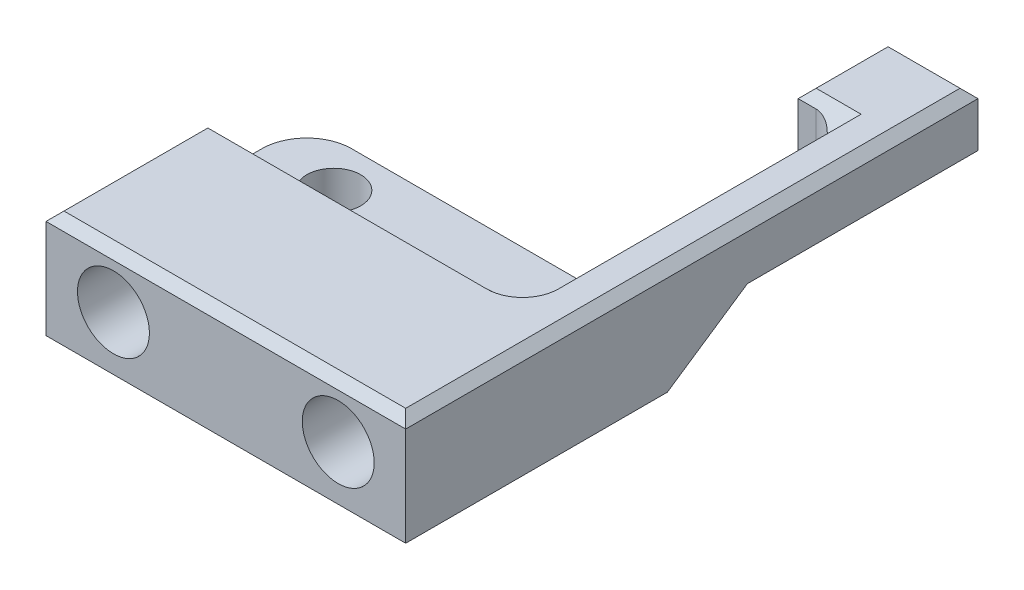
ISO-10303-21;
HEADER;
FILE_DESCRIPTION(('STEP AP214'),'2;1');
FILE_NAME('part.step','',(''),(''),'','','');
FILE_SCHEMA(('AUTOMOTIVE_DESIGN { 1 0 10303 214 1 1 1 1 }'));
ENDSEC;
DATA;
#1=APPLICATION_CONTEXT('core data for automotive mechanical design processes');
#2=APPLICATION_PROTOCOL_DEFINITION('international standard','automotive_design',2000,#1);
#3=PRODUCT_CONTEXT('',#1,'mechanical');
#4=PRODUCT('Part','Part','',(#3));
#5=PRODUCT_RELATED_PRODUCT_CATEGORY('part','',(#4));
#6=PRODUCT_DEFINITION_FORMATION('','',#4);
#7=PRODUCT_DEFINITION_CONTEXT('part definition',#1,'design');
#8=PRODUCT_DEFINITION('design','',#6,#7);
#9=PRODUCT_DEFINITION_SHAPE('','',#8);
#10=(LENGTH_UNIT() NAMED_UNIT(*) SI_UNIT(.MILLI.,.METRE.));
#11=(NAMED_UNIT(*) PLANE_ANGLE_UNIT() SI_UNIT($,.RADIAN.));
#12=(NAMED_UNIT(*) SI_UNIT($,.STERADIAN.) SOLID_ANGLE_UNIT());
#13=UNCERTAINTY_MEASURE_WITH_UNIT(LENGTH_MEASURE(1.E-05),#10,'distance_accuracy_value','');
#14=(GEOMETRIC_REPRESENTATION_CONTEXT(3) GLOBAL_UNCERTAINTY_ASSIGNED_CONTEXT((#13)) GLOBAL_UNIT_ASSIGNED_CONTEXT((#10,
#11,#12)) REPRESENTATION_CONTEXT('',''));
#15=CARTESIAN_POINT('',(0.,0.,0.));
#16=DIRECTION('',(0.,0.,1.));
#17=DIRECTION('',(1.,0.,0.));
#18=AXIS2_PLACEMENT_3D('',#15,#16,#17);
#19=CARTESIAN_POINT('',(-12.5,0.,-3.));
#20=DIRECTION('',(0.,0.,1.));
#21=DIRECTION('',(1.,0.,0.));
#22=AXIS2_PLACEMENT_3D('',#19,#20,#21);
#23=PLANE('',#22);
#24=DIRECTION('',(0.,1.,0.));
#25=VECTOR('',#24,1.);
#26=CARTESIAN_POINT('',(-20.,-88.,-3.));
#27=LINE('',#26,#25);
#28=CARTESIAN_POINT('',(-20.,8.99999999999999,-3.));
#29=VERTEX_POINT('',#28);
#30=CARTESIAN_POINT('',(-20.,11.,-3.));
#31=VERTEX_POINT('',#30);
#32=EDGE_CURVE('E243',#29,#31,#27,.T.);
#33=ORIENTED_EDGE('',*,*,#32,.T.);
#34=DIRECTION('',(1.,0.,0.));
#35=VECTOR('',#34,1.);
#36=CARTESIAN_POINT('',(-12.5,11.,-3.));
#37=LINE('',#36,#35);
#38=CARTESIAN_POINT('',(12.,11.,-3.));
#39=VERTEX_POINT('',#38);
#40=EDGE_CURVE('E440',#31,#39,#37,.T.);
#41=ORIENTED_EDGE('',*,*,#40,.T.);
#42=DIRECTION('',(0.,-1.,0.));
#43=VECTOR('',#42,1.);
#44=CARTESIAN_POINT('',(12.,0.,-3.));
#45=LINE('',#44,#43);
#46=CARTESIAN_POINT('',(12.,9.,-3.));
#47=VERTEX_POINT('',#46);
#48=EDGE_CURVE('E250',#39,#47,#45,.T.);
#49=ORIENTED_EDGE('',*,*,#48,.T.);
#50=DIRECTION('',(1.,0.,0.));
#51=VECTOR('',#50,1.);
#52=CARTESIAN_POINT('',(-20.,9.,-3.));
#53=LINE('',#52,#51);
#54=EDGE_CURVE('E252',#47,#29,#53,.F.);
#55=ORIENTED_EDGE('',*,*,#54,.T.);
#56=EDGE_LOOP('',(#33,#41,#49,#55));
#57=FACE_BOUND('',#56,.T.);
#58=ADVANCED_FACE('F34',(#57),#23,.F.);
#59=CARTESIAN_POINT('',(20.,12.,15.));
#60=DIRECTION('',(-1.,0.,0.));
#61=DIRECTION('',(0.,0.,1.));
#62=AXIS2_PLACEMENT_3D('',#59,#60,#61);
#63=PLANE('',#62);
#64=DIRECTION('',(0.,-1.,0.));
#65=VECTOR('',#64,1.);
#66=CARTESIAN_POINT('',(20.,58.7318147329736,-48.6493429113385));
#67=LINE('',#66,#65);
#68=CARTESIAN_POINT('',(20.,11.,-48.6493429113385));
#69=VERTEX_POINT('',#68);
#70=CARTESIAN_POINT('',(20.,6.,-48.6493429113385));
#71=VERTEX_POINT('',#70);
#72=EDGE_CURVE('E209',#69,#71,#67,.T.);
#73=ORIENTED_EDGE('',*,*,#72,.F.);
#74=DIRECTION('',(0.,0.,1.));
#75=VECTOR('',#74,1.);
#76=CARTESIAN_POINT('',(20.,11.,15.));
#77=LINE('',#76,#75);
#78=CARTESIAN_POINT('',(20.,11.,15.));
#79=VERTEX_POINT('',#78);
#80=EDGE_CURVE('E452',#69,#79,#77,.T.);
#81=ORIENTED_EDGE('',*,*,#80,.T.);
#82=DIRECTION('',(0.,-1.,0.));
#83=VECTOR('',#82,1.);
#84=CARTESIAN_POINT('',(20.,12.,15.));
#85=LINE('',#84,#83);
#86=CARTESIAN_POINT('',(20.,0.,15.));
#87=VERTEX_POINT('',#86);
#88=EDGE_CURVE('E509',#79,#87,#85,.T.);
#89=ORIENTED_EDGE('',*,*,#88,.T.);
#90=DIRECTION('',(0.,0.,-1.));
#91=VECTOR('',#90,1.);
#92=CARTESIAN_POINT('',(20.,0.,15.));
#93=LINE('',#92,#91);
#94=CARTESIAN_POINT('',(20.,0.,-14.1046341889236));
#95=VERTEX_POINT('',#94);
#96=EDGE_CURVE('E566',#87,#95,#93,.T.);
#97=ORIENTED_EDGE('',*,*,#96,.T.);
#98=DIRECTION('',(0.,0.559192903470748,-0.829037572555041));
#99=VECTOR('',#98,1.);
#100=CARTESIAN_POINT('',(20.,6.00000000000001,-23.));
#101=LINE('',#100,#99);
#102=CARTESIAN_POINT('',(20.,6.,-23.));
#103=VERTEX_POINT('',#102);
#104=EDGE_CURVE('E586',#95,#103,#101,.T.);
#105=ORIENTED_EDGE('',*,*,#104,.T.);
#106=DIRECTION('',(0.,0.,-1.));
#107=VECTOR('',#106,1.);
#108=CARTESIAN_POINT('',(20.,6.,0.));
#109=LINE('',#108,#107);
#110=EDGE_CURVE('E207',#103,#71,#109,.T.);
#111=ORIENTED_EDGE('',*,*,#110,.T.);
#112=EDGE_LOOP('',(#73,#81,#89,#97,#105,#111));
#113=FACE_BOUND('',#112,.T.);
#114=ADVANCED_FACE('F325',(#113),#63,.F.);
#115=CARTESIAN_POINT('',(-20.,12.,15.));
#116=DIRECTION('',(1.,0.,0.));
#117=DIRECTION('',(0.,0.,-1.));
#118=AXIS2_PLACEMENT_3D('',#115,#116,#117);
#119=PLANE('',#118);
#120=DIRECTION('',(0.,-1.,0.));
#121=VECTOR('',#120,1.);
#122=CARTESIAN_POINT('',(-20.,12.,15.));
#123=LINE('',#122,#121);
#124=CARTESIAN_POINT('',(-20.,11.,15.));
#125=VERTEX_POINT('',#124);
#126=CARTESIAN_POINT('',(-20.,0.,15.));
#127=VERTEX_POINT('',#126);
#128=EDGE_CURVE('E200',#125,#127,#123,.T.);
#129=ORIENTED_EDGE('',*,*,#128,.F.);
#130=DIRECTION('',(0.,0.,-1.));
#131=VECTOR('',#130,1.);
#132=CARTESIAN_POINT('',(-20.,11.,15.));
#133=LINE('',#132,#131);
#134=EDGE_CURVE('E438',#125,#31,#133,.T.);
#135=ORIENTED_EDGE('',*,*,#134,.T.);
#136=ORIENTED_EDGE('',*,*,#32,.F.);
#137=CARTESIAN_POINT('',(-20.,9.,-5.99999999999999));
#138=DIRECTION('',(1.,0.,0.));
#139=DIRECTION('',(0.,0.,-1.));
#140=AXIS2_PLACEMENT_3D('',#137,#138,#139);
#141=CIRCLE('',#140,3.);
#142=CARTESIAN_POINT('',(-20.,6.,-5.99999999999999));
#143=VERTEX_POINT('',#142);
#144=EDGE_CURVE('E259',#29,#143,#141,.T.);
#145=ORIENTED_EDGE('',*,*,#144,.T.);
#146=DIRECTION('',(0.,0.,1.));
#147=VECTOR('',#146,1.);
#148=CARTESIAN_POINT('',(-20.,6.,-23.));
#149=LINE('',#148,#147);
#150=CARTESIAN_POINT('',(-20.,6.,-9.));
#151=VERTEX_POINT('',#150);
#152=EDGE_CURVE('E208',#151,#143,#149,.T.);
#153=ORIENTED_EDGE('',*,*,#152,.F.);
#154=DIRECTION('',(0.,1.,0.));
#155=VECTOR('',#154,1.);
#156=CARTESIAN_POINT('',(-20.,12.,-9.));
#157=LINE('',#156,#155);
#158=CARTESIAN_POINT('',(-20.,0.,-9.));
#159=VERTEX_POINT('',#158);
#160=EDGE_CURVE('E366',#151,#159,#157,.F.);
#161=ORIENTED_EDGE('',*,*,#160,.T.);
#162=DIRECTION('',(0.,0.,1.));
#163=VECTOR('',#162,1.);
#164=CARTESIAN_POINT('',(-20.,0.,15.));
#165=LINE('',#164,#163);
#166=EDGE_CURVE('E570',#159,#127,#165,.T.);
#167=ORIENTED_EDGE('',*,*,#166,.T.);
#168=EDGE_LOOP('',(#129,#135,#136,#145,#153,#161,#167));
#169=FACE_BOUND('',#168,.T.);
#170=ADVANCED_FACE('F331',(#169),#119,.F.);
#171=CARTESIAN_POINT('',(-20.,12.,15.));
#172=DIRECTION('',(0.,0.,-1.));
#173=DIRECTION('',(-1.,0.,0.));
#174=AXIS2_PLACEMENT_3D('',#171,#172,#173);
#175=PLANE('',#174);
#176=CARTESIAN_POINT('',(12.5,6.,15.));
#177=DIRECTION('',(0.,0.,1.));
#178=DIRECTION('',(1.,0.,0.));
#179=AXIS2_PLACEMENT_3D('',#176,#177,#178);
#180=CIRCLE('',#179,4.);
#181=CARTESIAN_POINT('',(16.5,6.,15.));
#182=VERTEX_POINT('',#181);
#183=EDGE_CURVE('E247',#182,#182,#180,.T.);
#184=ORIENTED_EDGE('',*,*,#183,.F.);
#185=EDGE_LOOP('',(#184));
#186=FACE_BOUND('',#185,.T.);
#187=CARTESIAN_POINT('',(-12.5,6.,15.));
#188=DIRECTION('',(0.,0.,1.));
#189=DIRECTION('',(1.,0.,0.));
#190=AXIS2_PLACEMENT_3D('',#187,#188,#189);
#191=CIRCLE('',#190,4.);
#192=CARTESIAN_POINT('',(-8.5,6.,15.));
#193=VERTEX_POINT('',#192);
#194=EDGE_CURVE('E567',#193,#193,#191,.T.);
#195=ORIENTED_EDGE('',*,*,#194,.F.);
#196=EDGE_LOOP('',(#195));
#197=FACE_BOUND('',#196,.T.);
#198=ORIENTED_EDGE('',*,*,#88,.F.);
#199=DIRECTION('',(-1.,0.,0.));
#200=VECTOR('',#199,1.);
#201=CARTESIAN_POINT('',(-20.,11.,15.));
#202=LINE('',#201,#200);
#203=EDGE_CURVE('E435',#79,#125,#202,.T.);
#204=ORIENTED_EDGE('',*,*,#203,.T.);
#205=ORIENTED_EDGE('',*,*,#128,.T.);
#206=DIRECTION('',(1.,0.,0.));
#207=VECTOR('',#206,1.);
#208=CARTESIAN_POINT('',(-20.,0.,15.));
#209=LINE('',#208,#207);
#210=EDGE_CURVE('E576',#127,#87,#209,.T.);
#211=ORIENTED_EDGE('',*,*,#210,.T.);
#212=EDGE_LOOP('',(#198,#204,#205,#211));
#213=FACE_BOUND('',#212,.T.);
#214=ADVANCED_FACE('F342',(#186,#197,#213),#175,.F.);
#215=CARTESIAN_POINT('',(0.,12.,0.));
#216=DIRECTION('',(0.,-1.,0.));
#217=DIRECTION('',(0.,0.,-1.));
#218=AXIS2_PLACEMENT_3D('',#215,#216,#217);
#219=PLANE('',#218);
#220=DIRECTION('',(0.,0.,1.));
#221=VECTOR('',#220,1.);
#222=CARTESIAN_POINT('',(-19.,12.,0.));
#223=LINE('',#222,#221);
#224=CARTESIAN_POINT('',(-19.,12.,-2.));
#225=VERTEX_POINT('',#224);
#226=CARTESIAN_POINT('',(-19.,12.,14.));
#227=VERTEX_POINT('',#226);
#228=EDGE_CURVE('E430',#225,#227,#223,.T.);
#229=ORIENTED_EDGE('',*,*,#228,.T.);
#230=DIRECTION('',(1.,0.,0.));
#231=VECTOR('',#230,1.);
#232=CARTESIAN_POINT('',(0.,12.,14.));
#233=LINE('',#232,#231);
#234=CARTESIAN_POINT('',(19.,12.,14.));
#235=VERTEX_POINT('',#234);
#236=EDGE_CURVE('E432',#227,#235,#233,.T.);
#237=ORIENTED_EDGE('',*,*,#236,.T.);
#238=DIRECTION('',(0.,0.,-1.));
#239=VECTOR('',#238,1.);
#240=CARTESIAN_POINT('',(19.,12.,0.));
#241=LINE('',#240,#239);
#242=CARTESIAN_POINT('',(19.,12.,-47.6493429113385));
#243=VERTEX_POINT('',#242);
#244=EDGE_CURVE('E269',#235,#243,#241,.T.);
#245=ORIENTED_EDGE('',*,*,#244,.T.);
#246=DIRECTION('',(-1.,0.,0.));
#247=VECTOR('',#246,1.);
#248=CARTESIAN_POINT('',(0.,12.,-47.6493429113385));
#249=LINE('',#248,#247);
#250=CARTESIAN_POINT('',(11.,12.,-47.6493429113385));
#251=VERTEX_POINT('',#250);
#252=EDGE_CURVE('E418',#243,#251,#249,.T.);
#253=ORIENTED_EDGE('',*,*,#252,.T.);
#254=DIRECTION('',(0.,0.,1.));
#255=VECTOR('',#254,1.);
#256=CARTESIAN_POINT('',(11.,12.,0.));
#257=LINE('',#256,#255);
#258=CARTESIAN_POINT('',(11.,12.,-39.6493429113385));
#259=VERTEX_POINT('',#258);
#260=EDGE_CURVE('E420',#251,#259,#257,.T.);
#261=ORIENTED_EDGE('',*,*,#260,.T.);
#262=DIRECTION('',(1.,0.,0.));
#263=VECTOR('',#262,1.);
#264=CARTESIAN_POINT('',(15.,12.,-39.6493429113385));
#265=LINE('',#264,#263);
#266=CARTESIAN_POINT('',(16.,12.,-39.6493429113385));
#267=VERTEX_POINT('',#266);
#268=EDGE_CURVE('E422',#259,#267,#265,.T.);
#269=ORIENTED_EDGE('',*,*,#268,.T.);
#270=DIRECTION('',(0.,0.,1.));
#271=VECTOR('',#270,1.);
#272=CARTESIAN_POINT('',(16.,12.,-6.));
#273=LINE('',#272,#271);
#274=CARTESIAN_POINT('',(16.,12.,-6.));
#275=VERTEX_POINT('',#274);
#276=EDGE_CURVE('E424',#267,#275,#273,.T.);
#277=ORIENTED_EDGE('',*,*,#276,.T.);
#278=CARTESIAN_POINT('',(12.,12.,-6.));
#279=DIRECTION('',(0.,-1.,0.));
#280=DIRECTION('',(0.,0.,-1.));
#281=AXIS2_PLACEMENT_3D('',#278,#279,#280);
#282=CIRCLE('',#281,3.99999999999999);
#283=CARTESIAN_POINT('',(12.,12.,-2.));
#284=VERTEX_POINT('',#283);
#285=EDGE_CURVE('E426',#275,#284,#282,.T.);
#286=ORIENTED_EDGE('',*,*,#285,.T.);
#287=DIRECTION('',(-1.,0.,0.));
#288=VECTOR('',#287,1.);
#289=CARTESIAN_POINT('',(0.,12.,-2.));
#290=LINE('',#289,#288);
#291=EDGE_CURVE('E428',#284,#225,#290,.T.);
#292=ORIENTED_EDGE('',*,*,#291,.T.);
#293=EDGE_LOOP('',(#229,#237,#245,#253,#261,#269,#277,#286,#292));
#294=FACE_BOUND('',#293,.T.);
#295=ADVANCED_FACE('F338',(#294),#219,.F.);
#296=CARTESIAN_POINT('',(0.,0.,0.));
#297=DIRECTION('',(0.,-1.,0.));
#298=DIRECTION('',(0.,0.,-1.));
#299=AXIS2_PLACEMENT_3D('',#296,#297,#298);
#300=PLANE('',#299);
#301=ORIENTED_EDGE('',*,*,#166,.F.);
#302=CARTESIAN_POINT('',(-15.,0.,-9.));
#303=DIRECTION('',(0.,-1.,0.));
#304=DIRECTION('',(0.,0.,-1.));
#305=AXIS2_PLACEMENT_3D('',#302,#303,#304);
#306=CIRCLE('',#305,5.);
#307=CARTESIAN_POINT('',(-15.,0.,-14.));
#308=VERTEX_POINT('',#307);
#309=EDGE_CURVE('E365',#159,#308,#306,.T.);
#310=ORIENTED_EDGE('',*,*,#309,.T.);
#311=DIRECTION('',(-1.,0.,0.));
#312=VECTOR('',#311,1.);
#313=CARTESIAN_POINT('',(0.,0.,-14.));
#314=LINE('',#313,#312);
#315=CARTESIAN_POINT('',(10.,0.,-14.));
#316=VERTEX_POINT('',#315);
#317=EDGE_CURVE('E399',#316,#308,#314,.T.);
#318=ORIENTED_EDGE('',*,*,#317,.F.);
#319=CARTESIAN_POINT('',(10.,0.,-19.));
#320=DIRECTION('',(0.,-1.,0.));
#321=DIRECTION('',(0.,0.,-1.));
#322=AXIS2_PLACEMENT_3D('',#319,#320,#321);
#323=CIRCLE('',#322,5.);
#324=CARTESIAN_POINT('',(11.0175429110087,0.,-14.1046341889236));
#325=VERTEX_POINT('',#324);
#326=EDGE_CURVE('E381',#316,#325,#323,.F.);
#327=ORIENTED_EDGE('',*,*,#326,.T.);
#328=DIRECTION('',(1.,0.,0.));
#329=VECTOR('',#328,1.);
#330=CARTESIAN_POINT('',(20.,0.,-14.1046341889236));
#331=LINE('',#330,#329);
#332=EDGE_CURVE('E199',#325,#95,#331,.T.);
#333=ORIENTED_EDGE('',*,*,#332,.T.);
#334=ORIENTED_EDGE('',*,*,#96,.F.);
#335=ORIENTED_EDGE('',*,*,#210,.F.);
#336=EDGE_LOOP('',(#301,#310,#318,#327,#333,#334,#335));
#337=FACE_BOUND('',#336,.T.);
#338=CARTESIAN_POINT('',(-12.,0.,-9.));
#339=DIRECTION('',(0.,-1.,0.));
#340=DIRECTION('',(0.,0.,-1.));
#341=AXIS2_PLACEMENT_3D('',#338,#339,#340);
#342=CIRCLE('',#341,3.);
#343=CARTESIAN_POINT('',(-12.,0.,-12.));
#344=VERTEX_POINT('',#343);
#345=EDGE_CURVE('E216',#344,#344,#342,.T.);
#346=ORIENTED_EDGE('',*,*,#345,.F.);
#347=EDGE_LOOP('',(#346));
#348=FACE_BOUND('',#347,.T.);
#349=ADVANCED_FACE('F341',(#337,#348),#300,.T.);
#350=CARTESIAN_POINT('',(-12.5,6.,2.5));
#351=DIRECTION('',(0.,0.,1.));
#352=DIRECTION('',(1.,0.,0.));
#353=AXIS2_PLACEMENT_3D('',#350,#351,#352);
#354=CYLINDRICAL_SURFACE('',#353,4.);
#355=CARTESIAN_POINT('',(-12.5,6.,2.5));
#356=DIRECTION('',(0.,0.,1.));
#357=DIRECTION('',(1.,0.,0.));
#358=AXIS2_PLACEMENT_3D('',#355,#356,#357);
#359=CIRCLE('',#358,4.);
#360=CARTESIAN_POINT('',(-8.5,6.,2.5));
#361=VERTEX_POINT('',#360);
#362=EDGE_CURVE('E565',#361,#361,#359,.T.);
#363=ORIENTED_EDGE('',*,*,#362,.F.);
#364=EDGE_LOOP('',(#363));
#365=FACE_BOUND('',#364,.T.);
#366=ORIENTED_EDGE('',*,*,#194,.T.);
#367=EDGE_LOOP('',(#366));
#368=FACE_BOUND('',#367,.T.);
#369=ADVANCED_FACE('F336',(#365,#368),#354,.F.);
#370=CARTESIAN_POINT('',(-12.5,6.,2.5));
#371=DIRECTION('',(0.,0.,1.));
#372=DIRECTION('',(1.,0.,0.));
#373=AXIS2_PLACEMENT_3D('',#370,#371,#372);
#374=PLANE('',#373);
#375=ORIENTED_EDGE('',*,*,#362,.T.);
#376=EDGE_LOOP('',(#375));
#377=FACE_BOUND('',#376,.T.);
#378=ADVANCED_FACE('F555',(#377),#374,.T.);
#379=CARTESIAN_POINT('',(12.5,6.,2.5));
#380=DIRECTION('',(0.,0.,1.));
#381=DIRECTION('',(1.,0.,0.));
#382=AXIS2_PLACEMENT_3D('',#379,#380,#381);
#383=CYLINDRICAL_SURFACE('',#382,4.);
#384=CARTESIAN_POINT('',(12.5,6.,2.5));
#385=DIRECTION('',(0.,0.,1.));
#386=DIRECTION('',(1.,0.,0.));
#387=AXIS2_PLACEMENT_3D('',#384,#385,#386);
#388=CIRCLE('',#387,4.);
#389=CARTESIAN_POINT('',(16.5,6.,2.5));
#390=VERTEX_POINT('',#389);
#391=EDGE_CURVE('E240',#390,#390,#388,.T.);
#392=ORIENTED_EDGE('',*,*,#391,.F.);
#393=EDGE_LOOP('',(#392));
#394=FACE_BOUND('',#393,.T.);
#395=ORIENTED_EDGE('',*,*,#183,.T.);
#396=EDGE_LOOP('',(#395));
#397=FACE_BOUND('',#396,.T.);
#398=ADVANCED_FACE('F552',(#394,#397),#383,.F.);
#399=CARTESIAN_POINT('',(12.5,6.,2.5));
#400=DIRECTION('',(0.,0.,1.));
#401=DIRECTION('',(1.,0.,0.));
#402=AXIS2_PLACEMENT_3D('',#399,#400,#401);
#403=PLANE('',#402);
#404=ORIENTED_EDGE('',*,*,#391,.T.);
#405=EDGE_LOOP('',(#404));
#406=FACE_BOUND('',#405,.T.);
#407=ADVANCED_FACE('F549',(#406),#403,.T.);
#408=CARTESIAN_POINT('',(20.,6.,-23.));
#409=DIRECTION('',(0.,-1.,0.));
#410=DIRECTION('',(0.,0.,-1.));
#411=AXIS2_PLACEMENT_3D('',#408,#409,#410);
#412=PLANE('',#411);
#413=ORIENTED_EDGE('',*,*,#152,.T.);
#414=DIRECTION('',(1.,0.,0.));
#415=VECTOR('',#414,1.);
#416=CARTESIAN_POINT('',(15.,6.,-5.99999999999999));
#417=LINE('',#416,#415);
#418=CARTESIAN_POINT('',(-12.,6.,-5.99999999999999));
#419=VERTEX_POINT('',#418);
#420=EDGE_CURVE('E248',#143,#419,#417,.T.);
#421=ORIENTED_EDGE('',*,*,#420,.T.);
#422=CARTESIAN_POINT('',(-12.,6.,-9.));
#423=DIRECTION('',(0.,1.,0.));
#424=DIRECTION('',(0.,0.,1.));
#425=AXIS2_PLACEMENT_3D('',#422,#423,#424);
#426=CIRCLE('',#425,3.);
#427=EDGE_CURVE('E221',#419,#419,#426,.T.);
#428=ORIENTED_EDGE('',*,*,#427,.F.);
#429=DIRECTION('',(1.,0.,0.));
#430=VECTOR('',#429,1.);
#431=CARTESIAN_POINT('',(15.,6.,-5.99999999999999));
#432=LINE('',#431,#430);
#433=CARTESIAN_POINT('',(12.,6.,-5.99999999999999));
#434=VERTEX_POINT('',#433);
#435=EDGE_CURVE('E386',#419,#434,#432,.T.);
#436=ORIENTED_EDGE('',*,*,#435,.T.);
#437=DIRECTION('',(0.,0.,-1.));
#438=VECTOR('',#437,1.);
#439=CARTESIAN_POINT('',(12.,6.,-23.));
#440=LINE('',#439,#438);
#441=CARTESIAN_POINT('',(12.,6.,-14.4174243050442));
#442=VERTEX_POINT('',#441);
#443=EDGE_CURVE('E385',#434,#442,#440,.T.);
#444=ORIENTED_EDGE('',*,*,#443,.T.);
#445=CARTESIAN_POINT('',(10.,6.,-19.));
#446=DIRECTION('',(0.,-1.,0.));
#447=DIRECTION('',(0.,0.,-1.));
#448=AXIS2_PLACEMENT_3D('',#445,#446,#447);
#449=CIRCLE('',#448,5.);
#450=CARTESIAN_POINT('',(10.,6.,-14.));
#451=VERTEX_POINT('',#450);
#452=EDGE_CURVE('E374',#442,#451,#449,.T.);
#453=ORIENTED_EDGE('',*,*,#452,.T.);
#454=DIRECTION('',(1.,0.,0.));
#455=VECTOR('',#454,1.);
#456=CARTESIAN_POINT('',(-20.,6.,-14.));
#457=LINE('',#456,#455);
#458=CARTESIAN_POINT('',(-15.,6.,-14.));
#459=VERTEX_POINT('',#458);
#460=EDGE_CURVE('E400',#459,#451,#457,.T.);
#461=ORIENTED_EDGE('',*,*,#460,.F.);
#462=CARTESIAN_POINT('',(-15.,6.,-9.));
#463=DIRECTION('',(0.,-1.,0.));
#464=DIRECTION('',(0.,0.,-1.));
#465=AXIS2_PLACEMENT_3D('',#462,#463,#464);
#466=CIRCLE('',#465,5.);
#467=EDGE_CURVE('E376',#459,#151,#466,.F.);
#468=ORIENTED_EDGE('',*,*,#467,.T.);
#469=EDGE_LOOP('',(#413,#421,#428,#436,#444,#453,#461,#468));
#470=FACE_BOUND('',#469,.T.);
#471=ADVANCED_FACE('F394',(#470),#412,.F.);
#472=CARTESIAN_POINT('',(0.,6.,0.));
#473=DIRECTION('',(0.,1.,0.));
#474=DIRECTION('',(0.,0.,1.));
#475=AXIS2_PLACEMENT_3D('',#472,#473,#474);
#476=PLANE('',#475);
#477=ORIENTED_EDGE('',*,*,#110,.F.);
#478=DIRECTION('',(1.,0.,0.));
#479=VECTOR('',#478,1.);
#480=CARTESIAN_POINT('',(20.,6.,-23.));
#481=LINE('',#480,#479);
#482=CARTESIAN_POINT('',(15.,6.,-23.));
#483=VERTEX_POINT('',#482);
#484=EDGE_CURVE('E193',#483,#103,#481,.T.);
#485=ORIENTED_EDGE('',*,*,#484,.F.);
#486=DIRECTION('',(0.,0.,-1.));
#487=VECTOR('',#486,1.);
#488=CARTESIAN_POINT('',(15.,6.,0.));
#489=LINE('',#488,#487);
#490=CARTESIAN_POINT('',(15.,6.,-35.6493429113385));
#491=VERTEX_POINT('',#490);
#492=EDGE_CURVE('E204',#483,#491,#489,.T.);
#493=ORIENTED_EDGE('',*,*,#492,.T.);
#494=CARTESIAN_POINT('',(12.,6.,-35.6493429113385));
#495=DIRECTION('',(0.,1.,0.));
#496=DIRECTION('',(0.,0.,1.));
#497=AXIS2_PLACEMENT_3D('',#494,#495,#496);
#498=CIRCLE('',#497,3.);
#499=CARTESIAN_POINT('',(12.,6.,-38.6493429113385));
#500=VERTEX_POINT('',#499);
#501=EDGE_CURVE('E56',#491,#500,#498,.T.);
#502=ORIENTED_EDGE('',*,*,#501,.T.);
#503=DIRECTION('',(-1.,0.,0.));
#504=VECTOR('',#503,1.);
#505=CARTESIAN_POINT('',(0.,6.,-38.6493429113385));
#506=LINE('',#505,#504);
#507=CARTESIAN_POINT('',(10.,6.,-38.6493429113385));
#508=VERTEX_POINT('',#507);
#509=EDGE_CURVE('E230',#500,#508,#506,.T.);
#510=ORIENTED_EDGE('',*,*,#509,.T.);
#511=DIRECTION('',(0.,0.,1.));
#512=VECTOR('',#511,1.);
#513=CARTESIAN_POINT('',(10.,6.,0.));
#514=LINE('',#513,#512);
#515=CARTESIAN_POINT('',(9.99999999999999,6.,-48.6493429113385));
#516=VERTEX_POINT('',#515);
#517=EDGE_CURVE('E227',#516,#508,#514,.T.);
#518=ORIENTED_EDGE('',*,*,#517,.F.);
#519=DIRECTION('',(-1.,0.,0.));
#520=VECTOR('',#519,1.);
#521=CARTESIAN_POINT('',(0.,6.,-48.6493429113385));
#522=LINE('',#521,#520);
#523=EDGE_CURVE('E218',#71,#516,#522,.T.);
#524=ORIENTED_EDGE('',*,*,#523,.F.);
#525=EDGE_LOOP('',(#477,#485,#493,#502,#510,#518,#524));
#526=FACE_BOUND('',#525,.T.);
#527=ADVANCED_FACE('F203',(#526),#476,.F.);
#528=CARTESIAN_POINT('',(15.,58.7318147329736,0.));
#529=DIRECTION('',(-1.,0.,0.));
#530=DIRECTION('',(0.,0.,1.));
#531=AXIS2_PLACEMENT_3D('',#528,#529,#530);
#532=PLANE('',#531);
#533=DIRECTION('',(0.,0.,-1.));
#534=VECTOR('',#533,1.);
#535=CARTESIAN_POINT('',(15.,11.,-38.6493429113385));
#536=LINE('',#535,#534);
#537=CARTESIAN_POINT('',(15.,11.,-6.));
#538=VERTEX_POINT('',#537);
#539=CARTESIAN_POINT('',(15.,11.,-35.6493429113385));
#540=VERTEX_POINT('',#539);
#541=EDGE_CURVE('E444',#538,#540,#536,.T.);
#542=ORIENTED_EDGE('',*,*,#541,.T.);
#543=DIRECTION('',(0.,-1.,0.));
#544=VECTOR('',#543,1.);
#545=CARTESIAN_POINT('',(15.,6.,-35.6493429113385));
#546=LINE('',#545,#544);
#547=EDGE_CURVE('E215',#540,#491,#546,.T.);
#548=ORIENTED_EDGE('',*,*,#547,.T.);
#549=ORIENTED_EDGE('',*,*,#492,.F.);
#550=DIRECTION('',(0.,-0.559192903470748,0.829037572555041));
#551=VECTOR('',#550,1.);
#552=CARTESIAN_POINT('',(15.,11.8264502980897,-31.6380677969272));
#553=LINE('',#552,#551);
#554=CARTESIAN_POINT('',(15.,3.3019659326303,-19.));
#555=VERTEX_POINT('',#554);
#556=EDGE_CURVE('E189',#483,#555,#553,.T.);
#557=ORIENTED_EDGE('',*,*,#556,.T.);
#558=DIRECTION('',(0.,1.,0.));
#559=VECTOR('',#558,1.);
#560=CARTESIAN_POINT('',(15.,58.7318147329736,-19.));
#561=LINE('',#560,#559);
#562=CARTESIAN_POINT('',(15.,9.,-19.));
#563=VERTEX_POINT('',#562);
#564=EDGE_CURVE('E372',#555,#563,#561,.T.);
#565=ORIENTED_EDGE('',*,*,#564,.T.);
#566=DIRECTION('',(0.,0.,-1.));
#567=VECTOR('',#566,1.);
#568=CARTESIAN_POINT('',(15.,9.,0.));
#569=LINE('',#568,#567);
#570=CARTESIAN_POINT('',(15.,9.,-6.));
#571=VERTEX_POINT('',#570);
#572=EDGE_CURVE('E257',#563,#571,#569,.F.);
#573=ORIENTED_EDGE('',*,*,#572,.T.);
#574=DIRECTION('',(0.,-1.,0.));
#575=VECTOR('',#574,1.);
#576=CARTESIAN_POINT('',(15.,58.7318147329736,-6.));
#577=LINE('',#576,#575);
#578=EDGE_CURVE('E254',#571,#538,#577,.F.);
#579=ORIENTED_EDGE('',*,*,#578,.T.);
#580=EDGE_LOOP('',(#542,#548,#549,#557,#565,#573,#579));
#581=FACE_BOUND('',#580,.T.);
#582=ADVANCED_FACE('F213',(#581),#532,.T.);
#583=CARTESIAN_POINT('',(0.,58.7318147329736,-48.6493429113385));
#584=DIRECTION('',(0.,0.,1.));
#585=DIRECTION('',(1.,0.,0.));
#586=AXIS2_PLACEMENT_3D('',#583,#584,#585);
#587=PLANE('',#586);
#588=DIRECTION('',(0.,-1.,0.));
#589=VECTOR('',#588,1.);
#590=CARTESIAN_POINT('',(9.99999999999999,58.7318147329736,-48.6493429113385));
#591=LINE('',#590,#589);
#592=CARTESIAN_POINT('',(9.99999999999999,11.,-48.6493429113385));
#593=VERTEX_POINT('',#592);
#594=EDGE_CURVE('E235',#593,#516,#591,.T.);
#595=ORIENTED_EDGE('',*,*,#594,.F.);
#596=DIRECTION('',(1.,0.,0.));
#597=VECTOR('',#596,1.);
#598=CARTESIAN_POINT('',(0.,11.,-48.6493429113385));
#599=LINE('',#598,#597);
#600=EDGE_CURVE('E450',#593,#69,#599,.T.);
#601=ORIENTED_EDGE('',*,*,#600,.T.);
#602=ORIENTED_EDGE('',*,*,#72,.T.);
#603=ORIENTED_EDGE('',*,*,#523,.T.);
#604=EDGE_LOOP('',(#595,#601,#602,#603));
#605=FACE_BOUND('',#604,.T.);
#606=ADVANCED_FACE('F527',(#605),#587,.F.);
#607=CARTESIAN_POINT('',(10.,58.7318147329736,0.));
#608=DIRECTION('',(1.,0.,0.));
#609=DIRECTION('',(0.,0.,-1.));
#610=AXIS2_PLACEMENT_3D('',#607,#608,#609);
#611=PLANE('',#610);
#612=DIRECTION('',(0.,-1.,0.));
#613=VECTOR('',#612,1.);
#614=CARTESIAN_POINT('',(10.,58.7318147329736,-38.6493429113385));
#615=LINE('',#614,#613);
#616=CARTESIAN_POINT('',(10.,11.,-38.6493429113385));
#617=VERTEX_POINT('',#616);
#618=EDGE_CURVE('E232',#617,#508,#615,.T.);
#619=ORIENTED_EDGE('',*,*,#618,.F.);
#620=DIRECTION('',(0.,0.,-1.));
#621=VECTOR('',#620,1.);
#622=CARTESIAN_POINT('',(10.,11.,0.));
#623=LINE('',#622,#621);
#624=EDGE_CURVE('E448',#617,#593,#623,.T.);
#625=ORIENTED_EDGE('',*,*,#624,.T.);
#626=ORIENTED_EDGE('',*,*,#594,.T.);
#627=ORIENTED_EDGE('',*,*,#517,.T.);
#628=EDGE_LOOP('',(#619,#625,#626,#627));
#629=FACE_BOUND('',#628,.T.);
#630=ADVANCED_FACE('F525',(#629),#611,.F.);
#631=CARTESIAN_POINT('',(0.,58.7318147329736,-38.6493429113385));
#632=DIRECTION('',(0.,0.,1.));
#633=DIRECTION('',(1.,0.,0.));
#634=AXIS2_PLACEMENT_3D('',#631,#632,#633);
#635=PLANE('',#634);
#636=ORIENTED_EDGE('',*,*,#509,.F.);
#637=DIRECTION('',(0.,-1.,0.));
#638=VECTOR('',#637,1.);
#639=CARTESIAN_POINT('',(12.,11.,-38.6493429113385));
#640=LINE('',#639,#638);
#641=CARTESIAN_POINT('',(12.,11.,-38.6493429113385));
#642=VERTEX_POINT('',#641);
#643=EDGE_CURVE('E478',#500,#642,#640,.F.);
#644=ORIENTED_EDGE('',*,*,#643,.T.);
#645=DIRECTION('',(-1.,0.,0.));
#646=VECTOR('',#645,1.);
#647=CARTESIAN_POINT('',(10.,11.,-38.6493429113385));
#648=LINE('',#647,#646);
#649=EDGE_CURVE('E446',#642,#617,#648,.T.);
#650=ORIENTED_EDGE('',*,*,#649,.T.);
#651=ORIENTED_EDGE('',*,*,#618,.T.);
#652=EDGE_LOOP('',(#636,#644,#650,#651));
#653=FACE_BOUND('',#652,.T.);
#654=ADVANCED_FACE('F531',(#653),#635,.T.);
#655=CARTESIAN_POINT('',(-12.,-14.,-9.));
#656=DIRECTION('',(0.,1.,0.));
#657=DIRECTION('',(0.,0.,1.));
#658=AXIS2_PLACEMENT_3D('',#655,#656,#657);
#659=CYLINDRICAL_SURFACE('',#658,3.);
#660=ORIENTED_EDGE('',*,*,#345,.T.);
#661=EDGE_LOOP('',(#660));
#662=FACE_BOUND('',#661,.T.);
#663=ORIENTED_EDGE('',*,*,#427,.T.);
#664=EDGE_LOOP('',(#663));
#665=FACE_BOUND('',#664,.T.);
#666=ADVANCED_FACE('F398',(#662,#665),#659,.F.);
#667=CARTESIAN_POINT('',(-20.,-14.,-14.));
#668=DIRECTION('',(0.,0.,1.));
#669=DIRECTION('',(1.,0.,0.));
#670=AXIS2_PLACEMENT_3D('',#667,#668,#669);
#671=PLANE('',#670);
#672=ORIENTED_EDGE('',*,*,#317,.T.);
#673=DIRECTION('',(0.,1.,0.));
#674=VECTOR('',#673,1.);
#675=CARTESIAN_POINT('',(-15.,-14.,-14.));
#676=LINE('',#675,#674);
#677=EDGE_CURVE('E368',#308,#459,#676,.T.);
#678=ORIENTED_EDGE('',*,*,#677,.T.);
#679=ORIENTED_EDGE('',*,*,#460,.T.);
#680=DIRECTION('',(0.,1.,0.));
#681=VECTOR('',#680,1.);
#682=CARTESIAN_POINT('',(10.,-14.,-14.));
#683=LINE('',#682,#681);
#684=EDGE_CURVE('E585',#451,#316,#683,.F.);
#685=ORIENTED_EDGE('',*,*,#684,.T.);
#686=EDGE_LOOP('',(#672,#678,#679,#685));
#687=FACE_BOUND('',#686,.T.);
#688=ADVANCED_FACE('F355',(#687),#671,.F.);
#689=CARTESIAN_POINT('',(0.,6.00000000000001,-23.));
#690=DIRECTION('',(0.,-0.829037572555041,-0.559192903470748));
#691=DIRECTION('',(1.,0.,0.));
#692=AXIS2_PLACEMENT_3D('',#689,#690,#691);
#693=PLANE('',#692);
#694=ORIENTED_EDGE('',*,*,#104,.F.);
#695=ORIENTED_EDGE('',*,*,#332,.F.);
#696=CARTESIAN_POINT('',(10.,3.3019659326303,-19.));
#697=DIRECTION('',(0.,-0.829037572555041,-0.559192903470748));
#698=DIRECTION('',(0.,0.559192903470748,-0.829037572555041));
#699=AXIS2_PLACEMENT_3D('',#696,#697,#698);
#700=ELLIPSE('',#699,6.03108974251953,5.);
#701=EDGE_CURVE('E195',#325,#555,#700,.F.);
#702=ORIENTED_EDGE('',*,*,#701,.T.);
#703=ORIENTED_EDGE('',*,*,#556,.F.);
#704=ORIENTED_EDGE('',*,*,#484,.T.);
#705=EDGE_LOOP('',(#694,#695,#702,#703,#704));
#706=FACE_BOUND('',#705,.T.);
#707=ADVANCED_FACE('F192',(#706),#693,.T.);
#708=CARTESIAN_POINT('',(-15.,-14.,-9.));
#709=DIRECTION('',(0.,1.,0.));
#710=DIRECTION('',(0.,0.,1.));
#711=AXIS2_PLACEMENT_3D('',#708,#709,#710);
#712=CYLINDRICAL_SURFACE('',#711,5.);
#713=ORIENTED_EDGE('',*,*,#309,.F.);
#714=ORIENTED_EDGE('',*,*,#160,.F.);
#715=ORIENTED_EDGE('',*,*,#467,.F.);
#716=ORIENTED_EDGE('',*,*,#677,.F.);
#717=EDGE_LOOP('',(#713,#714,#715,#716));
#718=FACE_BOUND('',#717,.T.);
#719=ADVANCED_FACE('F354',(#718),#712,.T.);
#720=CARTESIAN_POINT('',(10.,58.7318147329736,-19.));
#721=DIRECTION('',(0.,1.,0.));
#722=DIRECTION('',(0.,0.,1.));
#723=AXIS2_PLACEMENT_3D('',#720,#721,#722);
#724=CYLINDRICAL_SURFACE('',#723,5.);
#725=ORIENTED_EDGE('',*,*,#326,.F.);
#726=ORIENTED_EDGE('',*,*,#684,.F.);
#727=ORIENTED_EDGE('',*,*,#452,.F.);
#728=CARTESIAN_POINT('',(12.,6.,-14.4174243050442));
#729=CARTESIAN_POINT('',(12.0888888800016,5.99999007584464,-14.4561943357268));
#730=CARTESIAN_POINT('',(12.1765760371668,6.00394885534584,-14.4975655315992));
#731=CARTESIAN_POINT('',(12.3487796580888,6.01909527387803,-14.58497092461));
#732=CARTESIAN_POINT('',(12.4333010723654,6.0302710810227,-14.6309973857434));
#733=CARTESIAN_POINT('',(12.5978580204897,6.05900041117813,-14.7268131506525));
#734=CARTESIAN_POINT('',(12.6779304900979,6.07648778239047,-14.7765593301304));
#735=CARTESIAN_POINT('',(12.8341677493548,6.11717439439445,-14.8797740298698));
#736=CARTESIAN_POINT('',(12.910330504919,6.14037657272063,-14.933244454304));
#737=CARTESIAN_POINT('',(13.0778234445788,6.19855781113315,-15.0578484246642));
#738=CARTESIAN_POINT('',(13.1679181687674,6.23503000053933,-15.1299471364075));
#739=CARTESIAN_POINT('',(13.3412421536811,6.31482188342729,-15.278555520239));
#740=CARTESIAN_POINT('',(13.4244663505316,6.3581465601076,-15.3550683764143));
#741=CARTESIAN_POINT('',(13.5842977070502,6.45077079658603,-15.5121042298434));
#742=CARTESIAN_POINT('',(13.6608739375952,6.50009596147952,-15.5926434824816));
#743=CARTESIAN_POINT('',(13.8070414732443,6.60362354169447,-15.7567746320005));
#744=CARTESIAN_POINT('',(13.8766348127498,6.65782452771141,-15.840365630047));
#745=CARTESIAN_POINT('',(14.0353769991902,6.79274014298286,-16.0439246355751));
#746=CARTESIAN_POINT('',(14.1212823730677,6.87542029554436,-16.1651272706597));
#747=CARTESIAN_POINT('',(14.2802850460761,7.04705542389689,-16.4114360963969));
#748=CARTESIAN_POINT('',(14.3533772312632,7.1360128852833,-16.5365438222705));
#749=CARTESIAN_POINT('',(14.487259092693,7.31881575359727,-16.7897906581943));
#750=CARTESIAN_POINT('',(14.5480444954728,7.41266284424724,-16.9179308040437));
#751=CARTESIAN_POINT('',(14.6577173885332,7.60404313592432,-17.1764388835742));
#752=CARTESIAN_POINT('',(14.7066067608367,7.70157575105513,-17.306806461365));
#753=CARTESIAN_POINT('',(14.8334976302998,7.99243555246817,-17.6926376210883));
#754=CARTESIAN_POINT('',(14.8956675498381,8.18963215160139,-17.9505018544793));
#755=CARTESIAN_POINT('',(14.9785799101262,8.5883952318271,-18.468600440045));
#756=CARTESIAN_POINT('',(14.9994066346161,8.78995197388524,-18.728828881522));
#757=CARTESIAN_POINT('',(14.9999958263799,8.99422653603215,-18.9925464893958));
#758=CARTESIAN_POINT('',(14.9999999927181,8.99711328912776,-18.9962732715914));
#759=CARTESIAN_POINT('',(15.,9.,-19.));
#760=B_SPLINE_CURVE_WITH_KNOTS('',3,(#728,#729,#730,#731,#732,#733,#734,#735,#736,#737,#738,
#739,#740,#741,#742,#743,#744,#745,#746,#747,#748,#749,#750,#751,#752,#753,#754,#755,#756,#757,
#758,#759),.UNSPECIFIED.,.F.,.F.,(4,2,2,2,2,2,2,2,2,2,2,2,2,2,2,4),(0.,0.290715926078973,
0.580956446582356,0.868239309782256,1.15567015190112,1.51818907481709,1.88097284765793,
2.24536288350867,2.60964644752272,3.11894232553607,3.6284410109764,4.13811631474609,
4.64771093234504,5.63631090330855,6.62289340018379,6.63703554133181),.UNSPECIFIED.);
#761=EDGE_CURVE('E261',#442,#563,#760,.T.);
#762=ORIENTED_EDGE('',*,*,#761,.T.);
#763=ORIENTED_EDGE('',*,*,#564,.F.);
#764=ORIENTED_EDGE('',*,*,#701,.F.);
#765=EDGE_LOOP('',(#725,#726,#727,#762,#763,#764));
#766=FACE_BOUND('',#765,.T.);
#767=ADVANCED_FACE('F272',(#766),#724,.F.);
#768=CARTESIAN_POINT('',(12.,9.,-23.));
#769=DIRECTION('',(0.,0.,-1.));
#770=DIRECTION('',(-1.,0.,0.));
#771=AXIS2_PLACEMENT_3D('',#768,#769,#770);
#772=CYLINDRICAL_SURFACE('',#771,3.);
#773=ORIENTED_EDGE('',*,*,#761,.F.);
#774=ORIENTED_EDGE('',*,*,#443,.F.);
#775=CARTESIAN_POINT('',(12.,9.,-6.));
#776=DIRECTION('',(0.,0.,-1.));
#777=DIRECTION('',(0.,1.,0.));
#778=AXIS2_PLACEMENT_3D('',#775,#776,#777);
#779=CIRCLE('',#778,3.);
#780=EDGE_CURVE('E404',#571,#434,#779,.T.);
#781=ORIENTED_EDGE('',*,*,#780,.F.);
#782=ORIENTED_EDGE('',*,*,#572,.F.);
#783=EDGE_LOOP('',(#773,#774,#781,#782));
#784=FACE_BOUND('',#783,.T.);
#785=ADVANCED_FACE('F276',(#784),#772,.F.);
#786=CARTESIAN_POINT('',(12.,0.,-6.));
#787=DIRECTION('',(0.,-1.,0.));
#788=DIRECTION('',(0.,0.,-1.));
#789=AXIS2_PLACEMENT_3D('',#786,#787,#788);
#790=CYLINDRICAL_SURFACE('',#789,3.);
#791=ORIENTED_EDGE('',*,*,#48,.F.);
#792=CARTESIAN_POINT('',(12.,11.,-6.));
#793=DIRECTION('',(0.,-1.,0.));
#794=DIRECTION('',(0.,0.,-1.));
#795=AXIS2_PLACEMENT_3D('',#792,#793,#794);
#796=CIRCLE('',#795,3.);
#797=EDGE_CURVE('E442',#39,#538,#796,.F.);
#798=ORIENTED_EDGE('',*,*,#797,.T.);
#799=ORIENTED_EDGE('',*,*,#578,.F.);
#800=CARTESIAN_POINT('',(12.,9.,-6.));
#801=DIRECTION('',(0.,1.,0.));
#802=DIRECTION('',(0.,0.,1.));
#803=AXIS2_PLACEMENT_3D('',#800,#801,#802);
#804=CIRCLE('',#803,3.);
#805=EDGE_CURVE('E409',#47,#571,#804,.T.);
#806=ORIENTED_EDGE('',*,*,#805,.F.);
#807=EDGE_LOOP('',(#791,#798,#799,#806));
#808=FACE_BOUND('',#807,.T.);
#809=ADVANCED_FACE('F281',(#808),#790,.F.);
#810=CARTESIAN_POINT('',(12.,9.,-6.));
#811=DIRECTION('',(0.,0.,1.));
#812=DIRECTION('',(1.,0.,0.));
#813=AXIS2_PLACEMENT_3D('',#810,#811,#812);
#814=SPHERICAL_SURFACE('',#813,3.);
#815=ORIENTED_EDGE('',*,*,#805,.T.);
#816=ORIENTED_EDGE('',*,*,#780,.T.);
#817=CARTESIAN_POINT('',(12.,9.,-5.99999999999999));
#818=DIRECTION('',(-1.,0.,0.));
#819=DIRECTION('',(0.,0.,1.));
#820=AXIS2_PLACEMENT_3D('',#817,#818,#819);
#821=CIRCLE('',#820,3.);
#822=EDGE_CURVE('E270',#47,#434,#821,.F.);
#823=ORIENTED_EDGE('',*,*,#822,.F.);
#824=EDGE_LOOP('',(#815,#816,#823));
#825=FACE_BOUND('',#824,.T.);
#826=ADVANCED_FACE('F321',(#825),#814,.F.);
#827=CARTESIAN_POINT('',(20.,9.,-5.99999999999999));
#828=DIRECTION('',(-1.,0.,0.));
#829=DIRECTION('',(0.,0.,1.));
#830=AXIS2_PLACEMENT_3D('',#827,#828,#829);
#831=CYLINDRICAL_SURFACE('',#830,3.);
#832=ORIENTED_EDGE('',*,*,#144,.F.);
#833=ORIENTED_EDGE('',*,*,#54,.F.);
#834=ORIENTED_EDGE('',*,*,#822,.T.);
#835=ORIENTED_EDGE('',*,*,#435,.F.);
#836=ORIENTED_EDGE('',*,*,#420,.F.);
#837=EDGE_LOOP('',(#832,#833,#834,#835,#836));
#838=FACE_BOUND('',#837,.T.);
#839=ADVANCED_FACE('F317',(#838),#831,.F.);
#840=CARTESIAN_POINT('',(16.,12.,0.));
#841=DIRECTION('',(-0.707106781186547,0.707106781186548,0.));
#842=DIRECTION('',(0.,0.,-1.));
#843=AXIS2_PLACEMENT_3D('',#840,#841,#842);
#844=PLANE('',#843);
#845=DIRECTION('',(-0.707106781186548,-0.707106781186547,0.));
#846=VECTOR('',#845,1.);
#847=CARTESIAN_POINT('',(16.,12.,-6.));
#848=LINE('',#847,#846);
#849=EDGE_CURVE('E473',#275,#538,#848,.T.);
#850=ORIENTED_EDGE('',*,*,#849,.F.);
#851=ORIENTED_EDGE('',*,*,#276,.F.);
#852=DIRECTION('',(0.577350269189626,0.577350269189625,-0.577350269189627));
#853=VECTOR('',#852,1.);
#854=CARTESIAN_POINT('',(2.78355236288713,-1.21644763711284,-26.4328952742256));
#855=LINE('',#854,#853);
#856=CARTESIAN_POINT('',(14.1213203435596,10.1213203435597,-37.7706632548982));
#857=VERTEX_POINT('',#856);
#858=EDGE_CURVE('E48',#857,#267,#855,.T.);
#859=ORIENTED_EDGE('',*,*,#858,.F.);
#860=CARTESIAN_POINT('',(12.,8.00000000000001,-35.6493429113385));
#861=DIRECTION('',(-0.707106781186547,0.707106781186548,0.));
#862=DIRECTION('',(0.707106781186548,0.707106781186547,0.));
#863=AXIS2_PLACEMENT_3D('',#860,#861,#862);
#864=ELLIPSE('',#863,4.24264068711928,3.);
#865=EDGE_CURVE('E11',#857,#540,#864,.F.);
#866=ORIENTED_EDGE('',*,*,#865,.T.);
#867=ORIENTED_EDGE('',*,*,#541,.F.);
#868=EDGE_LOOP('',(#850,#851,#859,#866,#867));
#869=FACE_BOUND('',#868,.T.);
#870=ADVANCED_FACE('F314',(#869),#844,.T.);
#871=CARTESIAN_POINT('',(0.,12.,-39.6493429113385));
#872=DIRECTION('',(0.,0.707106781186549,0.707106781186546));
#873=DIRECTION('',(-1.,0.,0.));
#874=AXIS2_PLACEMENT_3D('',#871,#872,#873);
#875=PLANE('',#874);
#876=ORIENTED_EDGE('',*,*,#858,.T.);
#877=ORIENTED_EDGE('',*,*,#268,.F.);
#878=DIRECTION('',(-0.577350269189626,-0.577350269189625,0.577350269189626));
#879=VECTOR('',#878,1.);
#880=CARTESIAN_POINT('',(-2.88311430377953,-1.88311430377948,-25.766228607559));
#881=LINE('',#880,#879);
#882=EDGE_CURVE('E470',#617,#259,#881,.F.);
#883=ORIENTED_EDGE('',*,*,#882,.F.);
#884=ORIENTED_EDGE('',*,*,#649,.F.);
#885=CARTESIAN_POINT('',(12.,8.00000000000001,-35.6493429113385));
#886=DIRECTION('',(0.,0.707106781186549,0.707106781186546));
#887=DIRECTION('',(0.,0.707106781186546,-0.707106781186549));
#888=AXIS2_PLACEMENT_3D('',#885,#886,#887);
#889=ELLIPSE('',#888,4.24264068711928,3.);
#890=EDGE_CURVE('E42',#642,#857,#889,.F.);
#891=ORIENTED_EDGE('',*,*,#890,.T.);
#892=EDGE_LOOP('',(#876,#877,#883,#884,#891));
#893=FACE_BOUND('',#892,.T.);
#894=ADVANCED_FACE('F311',(#893),#875,.T.);
#895=CARTESIAN_POINT('',(12.,12.,-6.));
#896=DIRECTION('',(0.,1.,0.));
#897=DIRECTION('',(0.,0.,1.));
#898=AXIS2_PLACEMENT_3D('',#895,#896,#897);
#899=CONICAL_SURFACE('',#898,3.99999999999999,0.785398163397448);
#900=ORIENTED_EDGE('',*,*,#849,.T.);
#901=ORIENTED_EDGE('',*,*,#797,.F.);
#902=DIRECTION('',(0.,-0.707106781186548,-0.707106781186547));
#903=VECTOR('',#902,1.);
#904=CARTESIAN_POINT('',(12.,12.,-2.));
#905=LINE('',#904,#903);
#906=EDGE_CURVE('E467',#284,#39,#905,.T.);
#907=ORIENTED_EDGE('',*,*,#906,.F.);
#908=ORIENTED_EDGE('',*,*,#285,.F.);
#909=EDGE_LOOP('',(#900,#901,#907,#908));
#910=FACE_BOUND('',#909,.T.);
#911=ADVANCED_FACE('F307',(#910),#899,.F.);
#912=CARTESIAN_POINT('',(10.,11.,0.));
#913=DIRECTION('',(0.707106781186546,-0.707106781186549,0.));
#914=DIRECTION('',(0.,0.,-1.));
#915=AXIS2_PLACEMENT_3D('',#912,#913,#914);
#916=PLANE('',#915);
#917=ORIENTED_EDGE('',*,*,#882,.T.);
#918=ORIENTED_EDGE('',*,*,#260,.F.);
#919=DIRECTION('',(0.577350269189627,0.577350269189624,0.577350269189626));
#920=VECTOR('',#919,1.);
#921=CARTESIAN_POINT('',(6.66666666666665,7.66666666666668,-51.9826762446719));
#922=LINE('',#921,#920);
#923=EDGE_CURVE('E464',#593,#251,#922,.T.);
#924=ORIENTED_EDGE('',*,*,#923,.F.);
#925=ORIENTED_EDGE('',*,*,#624,.F.);
#926=EDGE_LOOP('',(#917,#918,#924,#925));
#927=FACE_BOUND('',#926,.T.);
#928=ADVANCED_FACE('F303',(#927),#916,.F.);
#929=CARTESIAN_POINT('',(-12.5,11.,-3.));
#930=DIRECTION('',(0.,-0.707106781186547,0.707106781186547));
#931=DIRECTION('',(1.,0.,0.));
#932=AXIS2_PLACEMENT_3D('',#929,#930,#931);
#933=PLANE('',#932);
#934=ORIENTED_EDGE('',*,*,#906,.T.);
#935=ORIENTED_EDGE('',*,*,#40,.F.);
#936=DIRECTION('',(0.577350269189626,0.577350269189626,0.577350269189626));
#937=VECTOR('',#936,1.);
#938=CARTESIAN_POINT('',(-17.5,13.5,-0.499999999999994));
#939=LINE('',#938,#937);
#940=EDGE_CURVE('E461',#225,#31,#939,.F.);
#941=ORIENTED_EDGE('',*,*,#940,.F.);
#942=ORIENTED_EDGE('',*,*,#291,.F.);
#943=EDGE_LOOP('',(#934,#935,#941,#942));
#944=FACE_BOUND('',#943,.T.);
#945=ADVANCED_FACE('F299',(#944),#933,.F.);
#946=CARTESIAN_POINT('',(0.,11.,-48.6493429113385));
#947=DIRECTION('',(0.,-0.707106781186549,0.707106781186546));
#948=DIRECTION('',(1.,0.,0.));
#949=AXIS2_PLACEMENT_3D('',#946,#947,#948);
#950=PLANE('',#949);
#951=ORIENTED_EDGE('',*,*,#923,.T.);
#952=ORIENTED_EDGE('',*,*,#252,.F.);
#953=DIRECTION('',(-0.577350269189625,0.577350269189625,0.577350269189627));
#954=VECTOR('',#953,1.);
#955=CARTESIAN_POINT('',(3.11688569622048,27.8831143037795,-31.7662286075589));
#956=LINE('',#955,#954);
#957=EDGE_CURVE('E458',#69,#243,#956,.T.);
#958=ORIENTED_EDGE('',*,*,#957,.F.);
#959=ORIENTED_EDGE('',*,*,#600,.F.);
#960=EDGE_LOOP('',(#951,#952,#958,#959));
#961=FACE_BOUND('',#960,.T.);
#962=ADVANCED_FACE('F295',(#961),#950,.F.);
#963=CARTESIAN_POINT('',(-19.,12.,0.));
#964=DIRECTION('',(0.707106781186547,-0.707106781186547,0.));
#965=DIRECTION('',(0.,0.,1.));
#966=AXIS2_PLACEMENT_3D('',#963,#964,#965);
#967=PLANE('',#966);
#968=ORIENTED_EDGE('',*,*,#940,.T.);
#969=ORIENTED_EDGE('',*,*,#134,.F.);
#970=DIRECTION('',(0.577350269189626,0.577350269189626,-0.577350269189626));
#971=VECTOR('',#970,1.);
#972=CARTESIAN_POINT('',(-14.3333333333333,16.6666666666667,9.33333333333334));
#973=LINE('',#972,#971);
#974=EDGE_CURVE('E456',#227,#125,#973,.F.);
#975=ORIENTED_EDGE('',*,*,#974,.F.);
#976=ORIENTED_EDGE('',*,*,#228,.F.);
#977=EDGE_LOOP('',(#968,#969,#975,#976));
#978=FACE_BOUND('',#977,.T.);
#979=ADVANCED_FACE('F291',(#978),#967,.F.);
#980=CARTESIAN_POINT('',(19.,12.,0.));
#981=DIRECTION('',(-0.707106781186547,-0.707106781186547,0.));
#982=DIRECTION('',(0.,0.,-1.));
#983=AXIS2_PLACEMENT_3D('',#980,#981,#982);
#984=PLANE('',#983);
#985=ORIENTED_EDGE('',*,*,#957,.T.);
#986=ORIENTED_EDGE('',*,*,#244,.F.);
#987=DIRECTION('',(0.577350269189626,-0.577350269189626,0.577350269189626));
#988=VECTOR('',#987,1.);
#989=CARTESIAN_POINT('',(14.3333333333333,16.6666666666667,9.33333333333334));
#990=LINE('',#989,#988);
#991=EDGE_CURVE('E454',#79,#235,#990,.F.);
#992=ORIENTED_EDGE('',*,*,#991,.F.);
#993=ORIENTED_EDGE('',*,*,#80,.F.);
#994=EDGE_LOOP('',(#985,#986,#992,#993));
#995=FACE_BOUND('',#994,.T.);
#996=ADVANCED_FACE('F287',(#995),#984,.F.);
#997=CARTESIAN_POINT('',(0.,12.,14.));
#998=DIRECTION('',(0.,-0.707106781186547,-0.707106781186547));
#999=DIRECTION('',(1.,0.,0.));
#1000=AXIS2_PLACEMENT_3D('',#997,#998,#999);
#1001=PLANE('',#1000);
#1002=ORIENTED_EDGE('',*,*,#974,.T.);
#1003=ORIENTED_EDGE('',*,*,#203,.F.);
#1004=ORIENTED_EDGE('',*,*,#991,.T.);
#1005=ORIENTED_EDGE('',*,*,#236,.F.);
#1006=EDGE_LOOP('',(#1002,#1003,#1004,#1005));
#1007=FACE_BOUND('',#1006,.T.);
#1008=ADVANCED_FACE('F284',(#1007),#1001,.F.);
#1009=CARTESIAN_POINT('',(12.,58.7318147329736,-35.6493429113385));
#1010=DIRECTION('',(0.,1.,0.));
#1011=DIRECTION('',(0.,0.,1.));
#1012=AXIS2_PLACEMENT_3D('',#1009,#1010,#1011);
#1013=CYLINDRICAL_SURFACE('',#1012,3.);
#1014=ORIENTED_EDGE('',*,*,#890,.F.);
#1015=ORIENTED_EDGE('',*,*,#643,.F.);
#1016=ORIENTED_EDGE('',*,*,#501,.F.);
#1017=ORIENTED_EDGE('',*,*,#547,.F.);
#1018=ORIENTED_EDGE('',*,*,#865,.F.);
#1019=EDGE_LOOP('',(#1014,#1015,#1016,#1017,#1018));
#1020=FACE_BOUND('',#1019,.T.);
#1021=ADVANCED_FACE('F36',(#1020),#1013,.F.);
#1022=CLOSED_SHELL('',(#58,#114,#170,#214,#295,#349,#369,#378,#398,#407,#471,#527,#582,#606,
#630,#654,#666,#688,#707,#719,#767,#785,#809,#826,#839,#870,#894,#911,#928,#945,#962,#979,#996,
#1008,#1021));
#1023=MANIFOLD_SOLID_BREP('B2',#1022);
#1024=ADVANCED_BREP_SHAPE_REPRESENTATION('',(#18,#1023),#14);
#1025=SHAPE_DEFINITION_REPRESENTATION(#9,#1024);
ENDSEC;
END-ISO-10303-21;
